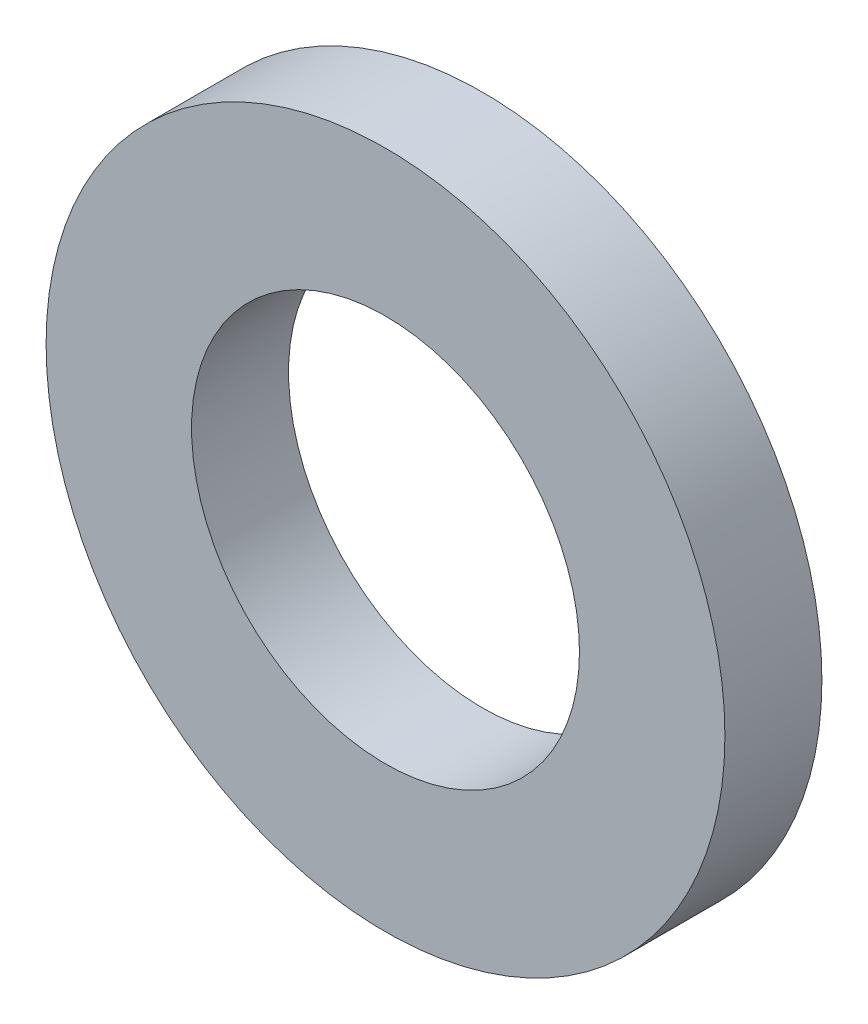
ISO-10303-21;
HEADER;
FILE_DESCRIPTION(('STEP AP214'),'2;1');
FILE_NAME('part.step','',(''),(''),'','','');
FILE_SCHEMA(('AUTOMOTIVE_DESIGN { 1 0 10303 214 1 1 1 1 }'));
ENDSEC;
DATA;
#1=APPLICATION_CONTEXT('core data for automotive mechanical design processes');
#2=APPLICATION_PROTOCOL_DEFINITION('international standard','automotive_design',2000,#1);
#3=PRODUCT_CONTEXT('',#1,'mechanical');
#4=PRODUCT('Part','Part','',(#3));
#5=PRODUCT_RELATED_PRODUCT_CATEGORY('part','',(#4));
#6=PRODUCT_DEFINITION_FORMATION('','',#4);
#7=PRODUCT_DEFINITION_CONTEXT('part definition',#1,'design');
#8=PRODUCT_DEFINITION('design','',#6,#7);
#9=PRODUCT_DEFINITION_SHAPE('','',#8);
#10=(LENGTH_UNIT() NAMED_UNIT(*) SI_UNIT(.MILLI.,.METRE.));
#11=(NAMED_UNIT(*) PLANE_ANGLE_UNIT() SI_UNIT($,.RADIAN.));
#12=(NAMED_UNIT(*) SI_UNIT($,.STERADIAN.) SOLID_ANGLE_UNIT());
#13=UNCERTAINTY_MEASURE_WITH_UNIT(LENGTH_MEASURE(1.E-05),#10,'distance_accuracy_value','');
#14=(GEOMETRIC_REPRESENTATION_CONTEXT(3) GLOBAL_UNCERTAINTY_ASSIGNED_CONTEXT((#13)) GLOBAL_UNIT_ASSIGNED_CONTEXT((#10,
#11,#12)) REPRESENTATION_CONTEXT('',''));
#15=CARTESIAN_POINT('',(0.,0.,0.));
#16=DIRECTION('',(0.,0.,1.));
#17=DIRECTION('',(1.,0.,0.));
#18=AXIS2_PLACEMENT_3D('',#15,#16,#17);
#19=CARTESIAN_POINT('',(0.,0.,1.));
#20=DIRECTION('',(0.,0.,1.));
#21=DIRECTION('',(1.,0.,0.));
#22=AXIS2_PLACEMENT_3D('',#19,#20,#21);
#23=PLANE('',#22);
#24=CARTESIAN_POINT('',(0.,0.,1.));
#25=DIRECTION('',(0.,0.,1.));
#26=DIRECTION('',(1.,0.,0.));
#27=AXIS2_PLACEMENT_3D('',#24,#25,#26);
#28=CIRCLE('',#27,3.5);
#29=CARTESIAN_POINT('',(3.5,0.,1.));
#30=VERTEX_POINT('',#29);
#31=EDGE_CURVE('E10',#30,#30,#28,.T.);
#32=ORIENTED_EDGE('',*,*,#31,.T.);
#33=EDGE_LOOP('',(#32));
#34=FACE_BOUND('',#33,.T.);
#35=CARTESIAN_POINT('',(0.,0.,1.));
#36=DIRECTION('',(0.,0.,1.));
#37=DIRECTION('',(1.,0.,0.));
#38=AXIS2_PLACEMENT_3D('',#35,#36,#37);
#39=CIRCLE('',#38,2.);
#40=CARTESIAN_POINT('',(2.,0.,1.));
#41=VERTEX_POINT('',#40);
#42=EDGE_CURVE('E42',#41,#41,#39,.T.);
#43=ORIENTED_EDGE('',*,*,#42,.F.);
#44=EDGE_LOOP('',(#43));
#45=FACE_BOUND('',#44,.T.);
#46=ADVANCED_FACE('F31',(#34,#45),#23,.T.);
#47=CARTESIAN_POINT('',(0.,0.,0.));
#48=DIRECTION('',(0.,0.,1.));
#49=DIRECTION('',(1.,0.,0.));
#50=AXIS2_PLACEMENT_3D('',#47,#48,#49);
#51=PLANE('',#50);
#52=CARTESIAN_POINT('',(0.,0.,0.));
#53=DIRECTION('',(0.,0.,1.));
#54=DIRECTION('',(1.,0.,0.));
#55=AXIS2_PLACEMENT_3D('',#52,#53,#54);
#56=CIRCLE('',#55,3.5);
#57=CARTESIAN_POINT('',(3.5,0.,0.));
#58=VERTEX_POINT('',#57);
#59=EDGE_CURVE('E35',#58,#58,#56,.T.);
#60=ORIENTED_EDGE('',*,*,#59,.F.);
#61=EDGE_LOOP('',(#60));
#62=FACE_BOUND('',#61,.T.);
#63=CARTESIAN_POINT('',(0.,0.,0.));
#64=DIRECTION('',(0.,0.,1.));
#65=DIRECTION('',(1.,0.,0.));
#66=AXIS2_PLACEMENT_3D('',#63,#64,#65);
#67=CIRCLE('',#66,2.);
#68=CARTESIAN_POINT('',(2.,0.,0.));
#69=VERTEX_POINT('',#68);
#70=EDGE_CURVE('E44',#69,#69,#67,.T.);
#71=ORIENTED_EDGE('',*,*,#70,.T.);
#72=EDGE_LOOP('',(#71));
#73=FACE_BOUND('',#72,.T.);
#74=ADVANCED_FACE('F54',(#62,#73),#51,.F.);
#75=CARTESIAN_POINT('',(0.,0.,1.));
#76=DIRECTION('',(0.,0.,-1.));
#77=DIRECTION('',(-1.,0.,0.));
#78=AXIS2_PLACEMENT_3D('',#75,#76,#77);
#79=CYLINDRICAL_SURFACE('',#78,3.5);
#80=ORIENTED_EDGE('',*,*,#31,.F.);
#81=EDGE_LOOP('',(#80));
#82=FACE_BOUND('',#81,.T.);
#83=ORIENTED_EDGE('',*,*,#59,.T.);
#84=EDGE_LOOP('',(#83));
#85=FACE_BOUND('',#84,.T.);
#86=ADVANCED_FACE('F33',(#82,#85),#79,.T.);
#87=CARTESIAN_POINT('',(0.,0.,1.));
#88=DIRECTION('',(0.,0.,-1.));
#89=DIRECTION('',(-1.,0.,0.));
#90=AXIS2_PLACEMENT_3D('',#87,#88,#89);
#91=CYLINDRICAL_SURFACE('',#90,2.);
#92=ORIENTED_EDGE('',*,*,#42,.T.);
#93=EDGE_LOOP('',(#92));
#94=FACE_BOUND('',#93,.T.);
#95=ORIENTED_EDGE('',*,*,#70,.F.);
#96=EDGE_LOOP('',(#95));
#97=FACE_BOUND('',#96,.T.);
#98=ADVANCED_FACE('F50',(#94,#97),#91,.F.);
#99=CLOSED_SHELL('',(#46,#74,#86,#98));
#100=MANIFOLD_SOLID_BREP('B2',#99);
#101=ADVANCED_BREP_SHAPE_REPRESENTATION('',(#18,#100),#14);
#102=SHAPE_DEFINITION_REPRESENTATION(#9,#101);
ENDSEC;
END-ISO-10303-21;
